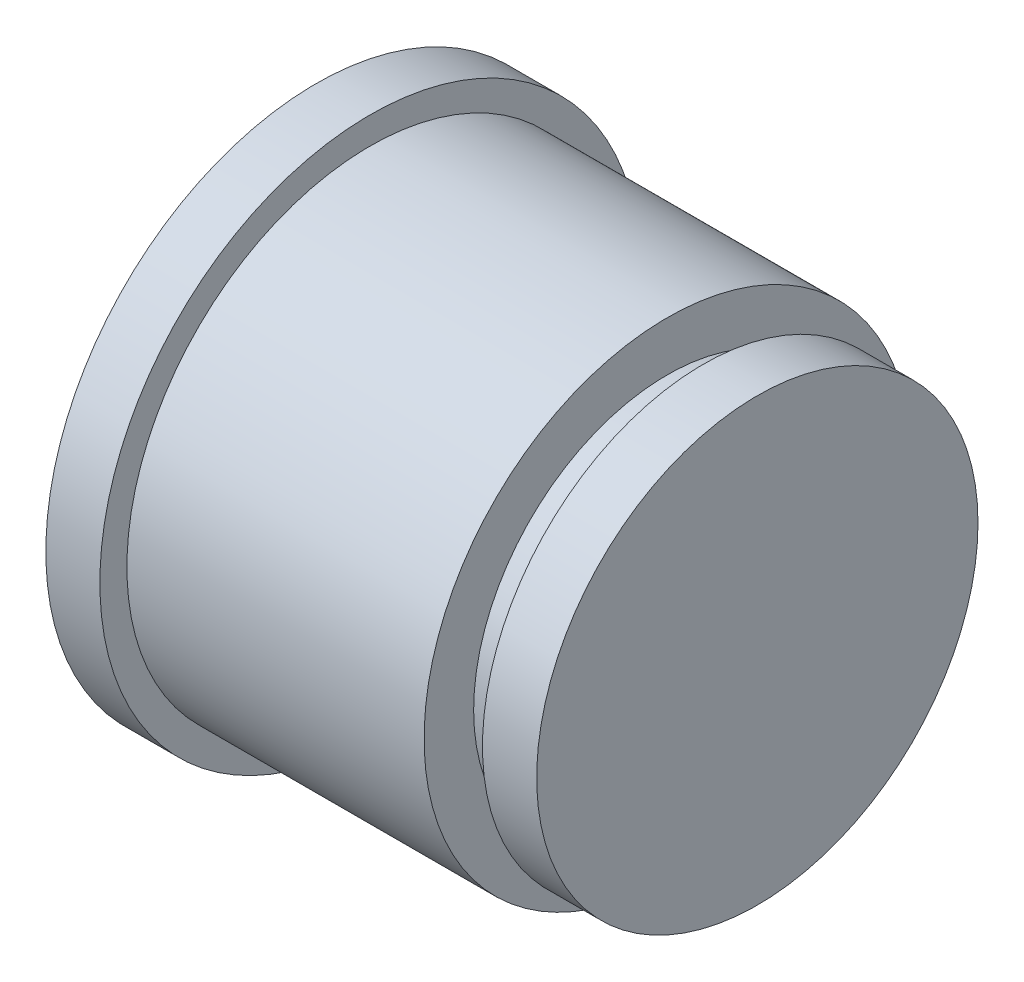
ISO-10303-21;
HEADER;
FILE_DESCRIPTION(('STEP AP214'),'2;1');
FILE_NAME('part.step','',(''),(''),'','','');
FILE_SCHEMA(('AUTOMOTIVE_DESIGN { 1 0 10303 214 1 1 1 1 }'));
ENDSEC;
DATA;
#1=APPLICATION_CONTEXT('core data for automotive mechanical design processes');
#2=APPLICATION_PROTOCOL_DEFINITION('international standard','automotive_design',2000,#1);
#3=PRODUCT_CONTEXT('',#1,'mechanical');
#4=PRODUCT('Part','Part','',(#3));
#5=PRODUCT_RELATED_PRODUCT_CATEGORY('part','',(#4));
#6=PRODUCT_DEFINITION_FORMATION('','',#4);
#7=PRODUCT_DEFINITION_CONTEXT('part definition',#1,'design');
#8=PRODUCT_DEFINITION('design','',#6,#7);
#9=PRODUCT_DEFINITION_SHAPE('','',#8);
#10=(LENGTH_UNIT() NAMED_UNIT(*) SI_UNIT(.MILLI.,.METRE.));
#11=(NAMED_UNIT(*) PLANE_ANGLE_UNIT() SI_UNIT($,.RADIAN.));
#12=(NAMED_UNIT(*) SI_UNIT($,.STERADIAN.) SOLID_ANGLE_UNIT());
#13=UNCERTAINTY_MEASURE_WITH_UNIT(LENGTH_MEASURE(1.E-05),#10,'distance_accuracy_value','');
#14=(GEOMETRIC_REPRESENTATION_CONTEXT(3) GLOBAL_UNCERTAINTY_ASSIGNED_CONTEXT((#13)) GLOBAL_UNIT_ASSIGNED_CONTEXT((#10,
#11,#12)) REPRESENTATION_CONTEXT('',''));
#15=CARTESIAN_POINT('',(0.,0.,0.));
#16=DIRECTION('',(0.,0.,1.));
#17=DIRECTION('',(1.,0.,0.));
#18=AXIS2_PLACEMENT_3D('',#15,#16,#17);
#19=CARTESIAN_POINT('',(39.,0.,0.));
#20=DIRECTION('',(1.,0.,0.));
#21=DIRECTION('',(0.,0.,-1.));
#22=AXIS2_PLACEMENT_3D('',#19,#20,#21);
#23=PLANE('',#22);
#24=CARTESIAN_POINT('',(39.,0.,0.));
#25=DIRECTION('',(1.,0.,0.));
#26=DIRECTION('',(0.,0.,-1.));
#27=AXIS2_PLACEMENT_3D('',#24,#25,#26);
#28=CIRCLE('',#27,27.);
#29=CARTESIAN_POINT('',(39.,0.,-27.));
#30=VERTEX_POINT('',#29);
#31=EDGE_CURVE('E49',#30,#30,#28,.T.);
#32=ORIENTED_EDGE('',*,*,#31,.T.);
#33=EDGE_LOOP('',(#32));
#34=FACE_BOUND('',#33,.T.);
#35=CARTESIAN_POINT('',(39.,0.,0.));
#36=DIRECTION('',(1.,0.,0.));
#37=DIRECTION('',(0.,0.,-1.));
#38=AXIS2_PLACEMENT_3D('',#35,#36,#37);
#39=CIRCLE('',#38,21.5);
#40=CARTESIAN_POINT('',(39.,0.,-21.5));
#41=VERTEX_POINT('',#40);
#42=EDGE_CURVE('E54',#41,#41,#39,.T.);
#43=ORIENTED_EDGE('',*,*,#42,.F.);
#44=EDGE_LOOP('',(#43));
#45=FACE_BOUND('',#44,.T.);
#46=ADVANCED_FACE('F30',(#34,#45),#23,.T.);
#47=CARTESIAN_POINT('',(6.,0.,0.));
#48=DIRECTION('',(1.,0.,0.));
#49=DIRECTION('',(0.,0.,-1.));
#50=AXIS2_PLACEMENT_3D('',#47,#48,#49);
#51=PLANE('',#50);
#52=CARTESIAN_POINT('',(6.,0.,0.));
#53=DIRECTION('',(1.,0.,0.));
#54=DIRECTION('',(0.,0.,-1.));
#55=AXIS2_PLACEMENT_3D('',#52,#53,#54);
#56=CIRCLE('',#55,30.);
#57=CARTESIAN_POINT('',(6.,0.,-30.));
#58=VERTEX_POINT('',#57);
#59=EDGE_CURVE('E41',#58,#58,#56,.T.);
#60=ORIENTED_EDGE('',*,*,#59,.T.);
#61=EDGE_LOOP('',(#60));
#62=FACE_BOUND('',#61,.T.);
#63=CARTESIAN_POINT('',(6.,0.,0.));
#64=DIRECTION('',(1.,0.,0.));
#65=DIRECTION('',(0.,0.,-1.));
#66=AXIS2_PLACEMENT_3D('',#63,#64,#65);
#67=CIRCLE('',#66,27.);
#68=CARTESIAN_POINT('',(6.,0.,-27.));
#69=VERTEX_POINT('',#68);
#70=EDGE_CURVE('E51',#69,#69,#67,.T.);
#71=ORIENTED_EDGE('',*,*,#70,.F.);
#72=EDGE_LOOP('',(#71));
#73=FACE_BOUND('',#72,.T.);
#74=ADVANCED_FACE('F77',(#62,#73),#51,.T.);
#75=CARTESIAN_POINT('',(6.,0.,0.));
#76=DIRECTION('',(-1.,0.,0.));
#77=DIRECTION('',(0.,0.,1.));
#78=AXIS2_PLACEMENT_3D('',#75,#76,#77);
#79=CYLINDRICAL_SURFACE('',#78,30.);
#80=ORIENTED_EDGE('',*,*,#59,.F.);
#81=EDGE_LOOP('',(#80));
#82=FACE_BOUND('',#81,.T.);
#83=CARTESIAN_POINT('',(0.,0.,0.));
#84=DIRECTION('',(1.,0.,0.));
#85=DIRECTION('',(0.,0.,-1.));
#86=AXIS2_PLACEMENT_3D('',#83,#84,#85);
#87=CIRCLE('',#86,30.);
#88=CARTESIAN_POINT('',(0.,0.,-30.));
#89=VERTEX_POINT('',#88);
#90=EDGE_CURVE('E45',#89,#89,#87,.T.);
#91=ORIENTED_EDGE('',*,*,#90,.T.);
#92=EDGE_LOOP('',(#91));
#93=FACE_BOUND('',#92,.T.);
#94=ADVANCED_FACE('F83',(#82,#93),#79,.T.);
#95=CARTESIAN_POINT('',(0.,0.,0.));
#96=DIRECTION('',(1.,0.,0.));
#97=DIRECTION('',(0.,0.,-1.));
#98=AXIS2_PLACEMENT_3D('',#95,#96,#97);
#99=PLANE('',#98);
#100=ORIENTED_EDGE('',*,*,#90,.F.);
#101=EDGE_LOOP('',(#100));
#102=FACE_BOUND('',#101,.T.);
#103=ADVANCED_FACE('F89',(#102),#99,.F.);
#104=CARTESIAN_POINT('',(39.,0.,0.));
#105=DIRECTION('',(-1.,0.,0.));
#106=DIRECTION('',(0.,0.,1.));
#107=AXIS2_PLACEMENT_3D('',#104,#105,#106);
#108=CYLINDRICAL_SURFACE('',#107,27.);
#109=ORIENTED_EDGE('',*,*,#31,.F.);
#110=EDGE_LOOP('',(#109));
#111=FACE_BOUND('',#110,.T.);
#112=ORIENTED_EDGE('',*,*,#70,.T.);
#113=EDGE_LOOP('',(#112));
#114=FACE_BOUND('',#113,.T.);
#115=ADVANCED_FACE('F74',(#111,#114),#108,.T.);
#116=CARTESIAN_POINT('',(43.,0.,0.));
#117=DIRECTION('',(-1.,0.,0.));
#118=DIRECTION('',(0.,0.,1.));
#119=AXIS2_PLACEMENT_3D('',#116,#117,#118);
#120=CYLINDRICAL_SURFACE('',#119,21.5);
#121=CARTESIAN_POINT('',(42.45,0.,0.));
#122=DIRECTION('',(1.,0.,0.));
#123=DIRECTION('',(0.,0.,-1.));
#124=AXIS2_PLACEMENT_3D('',#121,#122,#123);
#125=CIRCLE('',#124,21.5);
#126=CARTESIAN_POINT('',(42.45,0.,-21.5));
#127=VERTEX_POINT('',#126);
#128=EDGE_CURVE('E37',#127,#127,#125,.F.);
#129=ORIENTED_EDGE('',*,*,#128,.T.);
#130=EDGE_LOOP('',(#129));
#131=FACE_BOUND('',#130,.T.);
#132=ORIENTED_EDGE('',*,*,#42,.T.);
#133=EDGE_LOOP('',(#132));
#134=FACE_BOUND('',#133,.T.);
#135=ADVANCED_FACE('F67',(#131,#134),#120,.T.);
#136=CARTESIAN_POINT('',(49.,0.,0.));
#137=DIRECTION('',(-1.,0.,0.));
#138=DIRECTION('',(0.,0.,1.));
#139=AXIS2_PLACEMENT_3D('',#136,#137,#138);
#140=CYLINDRICAL_SURFACE('',#139,24.5);
#141=CARTESIAN_POINT('',(42.9789809421254,0.,0.));
#142=DIRECTION('',(1.,0.,0.));
#143=DIRECTION('',(0.,0.,-1.));
#144=AXIS2_PLACEMENT_3D('',#141,#142,#143);
#145=CIRCLE('',#144,24.5);
#146=CARTESIAN_POINT('',(42.9789809421254,0.,-24.5));
#147=VERTEX_POINT('',#146);
#148=EDGE_CURVE('E10',#147,#147,#145,.T.);
#149=ORIENTED_EDGE('',*,*,#148,.T.);
#150=EDGE_LOOP('',(#149));
#151=FACE_BOUND('',#150,.T.);
#152=CARTESIAN_POINT('',(49.,0.,0.));
#153=DIRECTION('',(1.,0.,0.));
#154=DIRECTION('',(0.,0.,-1.));
#155=AXIS2_PLACEMENT_3D('',#152,#153,#154);
#156=CIRCLE('',#155,24.5);
#157=CARTESIAN_POINT('',(49.,0.,-24.5));
#158=VERTEX_POINT('',#157);
#159=EDGE_CURVE('E59',#158,#158,#156,.T.);
#160=ORIENTED_EDGE('',*,*,#159,.F.);
#161=EDGE_LOOP('',(#160));
#162=FACE_BOUND('',#161,.T.);
#163=ADVANCED_FACE('F65',(#151,#162),#140,.T.);
#164=CARTESIAN_POINT('',(49.,0.,0.));
#165=DIRECTION('',(1.,0.,0.));
#166=DIRECTION('',(0.,0.,-1.));
#167=AXIS2_PLACEMENT_3D('',#164,#165,#166);
#168=PLANE('',#167);
#169=ORIENTED_EDGE('',*,*,#159,.T.);
#170=EDGE_LOOP('',(#169));
#171=FACE_BOUND('',#170,.T.);
#172=ADVANCED_FACE('F63',(#171),#168,.T.);
#173=CARTESIAN_POINT('',(43.,0.,0.));
#174=DIRECTION('',(1.,0.,0.));
#175=DIRECTION('',(0.,0.,-1.));
#176=AXIS2_PLACEMENT_3D('',#173,#174,#175);
#177=CONICAL_SURFACE('',#176,24.6192050007899,1.39626340159547);
#178=ORIENTED_EDGE('',*,*,#128,.F.);
#179=EDGE_LOOP('',(#178));
#180=FACE_BOUND('',#179,.T.);
#181=ORIENTED_EDGE('',*,*,#148,.F.);
#182=EDGE_LOOP('',(#181));
#183=FACE_BOUND('',#182,.T.);
#184=ADVANCED_FACE('F32',(#180,#183),#177,.T.);
#185=CLOSED_SHELL('',(#46,#74,#94,#103,#115,#135,#163,#172,#184));
#186=MANIFOLD_SOLID_BREP('B2',#185);
#187=ADVANCED_BREP_SHAPE_REPRESENTATION('',(#18,#186),#14);
#188=SHAPE_DEFINITION_REPRESENTATION(#9,#187);
ENDSEC;
END-ISO-10303-21;
